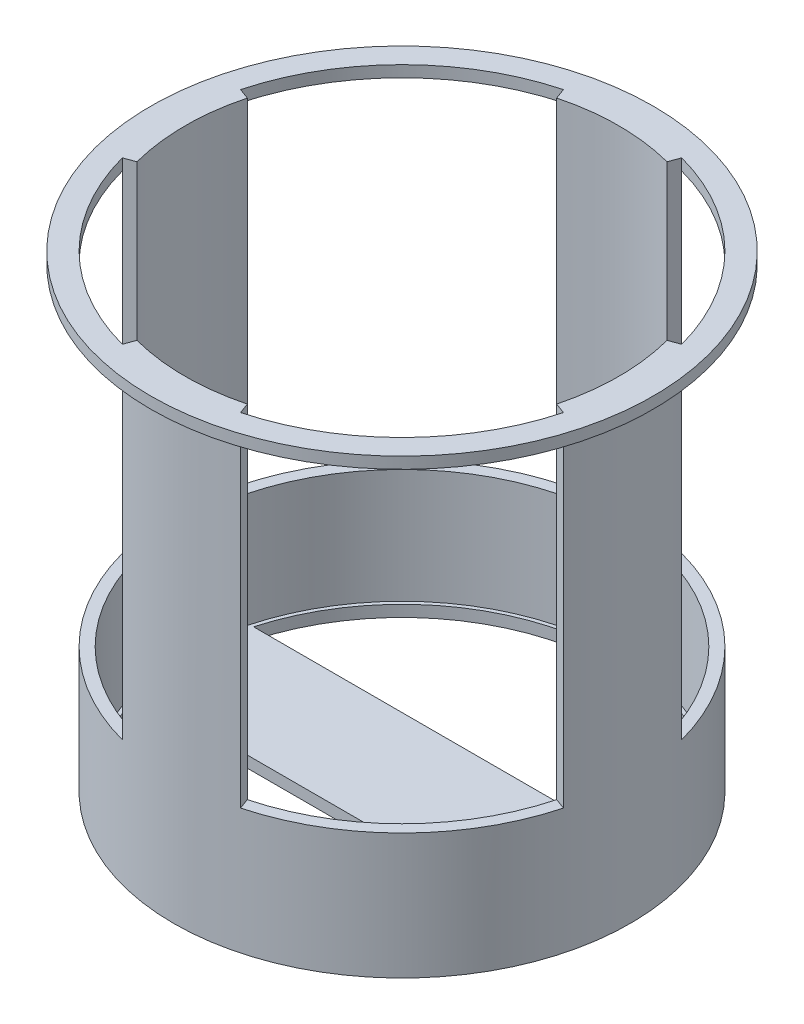
ISO-10303-21;
HEADER;
FILE_DESCRIPTION(('STEP AP214'),'2;1');
FILE_NAME('part.step','',(''),(''),'','','');
FILE_SCHEMA(('AUTOMOTIVE_DESIGN { 1 0 10303 214 1 1 1 1 }'));
ENDSEC;
DATA;
#1=APPLICATION_CONTEXT('core data for automotive mechanical design processes');
#2=APPLICATION_PROTOCOL_DEFINITION('international standard','automotive_design',2000,#1);
#3=PRODUCT_CONTEXT('',#1,'mechanical');
#4=PRODUCT('Part','Part','',(#3));
#5=PRODUCT_RELATED_PRODUCT_CATEGORY('part','',(#4));
#6=PRODUCT_DEFINITION_FORMATION('','',#4);
#7=PRODUCT_DEFINITION_CONTEXT('part definition',#1,'design');
#8=PRODUCT_DEFINITION('design','',#6,#7);
#9=PRODUCT_DEFINITION_SHAPE('','',#8);
#10=(LENGTH_UNIT() NAMED_UNIT(*) SI_UNIT(.MILLI.,.METRE.));
#11=(NAMED_UNIT(*) PLANE_ANGLE_UNIT() SI_UNIT($,.RADIAN.));
#12=(NAMED_UNIT(*) SI_UNIT($,.STERADIAN.) SOLID_ANGLE_UNIT());
#13=UNCERTAINTY_MEASURE_WITH_UNIT(LENGTH_MEASURE(1.E-05),#10,'distance_accuracy_value','');
#14=(GEOMETRIC_REPRESENTATION_CONTEXT(3) GLOBAL_UNCERTAINTY_ASSIGNED_CONTEXT((#13)) GLOBAL_UNIT_ASSIGNED_CONTEXT((#10,
#11,#12)) REPRESENTATION_CONTEXT('',''));
#15=CARTESIAN_POINT('',(0.,0.,0.));
#16=DIRECTION('',(0.,0.,1.));
#17=DIRECTION('',(1.,0.,0.));
#18=AXIS2_PLACEMENT_3D('',#15,#16,#17);
#19=CARTESIAN_POINT('',(0.,-39.,0.));
#20=DIRECTION('',(0.,1.,0.));
#21=DIRECTION('',(0.,0.,1.));
#22=AXIS2_PLACEMENT_3D('',#19,#20,#21);
#23=PLANE('',#22);
#24=CARTESIAN_POINT('',(0.,-39.,0.));
#25=DIRECTION('',(0.,1.,0.));
#26=DIRECTION('',(0.,0.,1.));
#27=AXIS2_PLACEMENT_3D('',#24,#25,#26);
#28=CIRCLE('',#27,19.0041470652043);
#29=CARTESIAN_POINT('',(-18.3789578178851,-39.,4.83440949903036));
#30=VERTEX_POINT('',#29);
#31=CARTESIAN_POINT('',(-4.83529775518471,-39.,18.3787241476284));
#32=VERTEX_POINT('',#31);
#33=EDGE_CURVE('E301',#30,#32,#28,.T.);
#34=ORIENTED_EDGE('',*,*,#33,.T.);
#35=DIRECTION('',(-0.341160355566479,0.,0.940005112640221));
#36=VECTOR('',#35,1.);
#37=CARTESIAN_POINT('',(-4.8352491416951,-39.,18.3785902020277));
#38=LINE('',#37,#36);
#39=CARTESIAN_POINT('',(-4.8352491416951,-39.,18.3785902020277));
#40=VERTEX_POINT('',#39);
#41=EDGE_CURVE('E415',#40,#32,#38,.T.);
#42=ORIENTED_EDGE('',*,*,#41,.F.);
#43=CARTESIAN_POINT('',(0.,-39.,0.));
#44=DIRECTION('',(0.,-1.,0.));
#45=DIRECTION('',(0.,0.,-1.));
#46=AXIS2_PLACEMENT_3D('',#43,#44,#45);
#47=CIRCLE('',#46,19.0040051588167);
#48=CARTESIAN_POINT('',(4.83436075872464,-39.,18.3788239049955));
#49=VERTEX_POINT('',#48);
#50=EDGE_CURVE('E421',#49,#40,#47,.T.);
#51=ORIENTED_EDGE('',*,*,#50,.F.);
#52=DIRECTION('',(-0.34202014332566,0.,-0.939692620785912));
#53=VECTOR('',#52,1.);
#54=CARTESIAN_POINT('',(5.1763809020503,-39.,19.3185165257814));
#55=LINE('',#54,#53);
#56=CARTESIAN_POINT('',(4.83440949903042,-39.,18.378957817885));
#57=VERTEX_POINT('',#56);
#58=EDGE_CURVE('E426',#57,#49,#55,.T.);
#59=ORIENTED_EDGE('',*,*,#58,.F.);
#60=CARTESIAN_POINT('',(18.3787241476284,-39.,4.83529775518464));
#61=VERTEX_POINT('',#60);
#62=EDGE_CURVE('E309',#57,#61,#28,.T.);
#63=ORIENTED_EDGE('',*,*,#62,.T.);
#64=DIRECTION('',(0.940005112640222,0.,0.341160355566474));
#65=VECTOR('',#64,1.);
#66=CARTESIAN_POINT('',(18.3785902020277,-39.,4.83524914169503));
#67=LINE('',#66,#65);
#68=CARTESIAN_POINT('',(18.3785902020277,-39.,4.83524914169503));
#69=VERTEX_POINT('',#68);
#70=EDGE_CURVE('E455',#69,#61,#67,.T.);
#71=ORIENTED_EDGE('',*,*,#70,.F.);
#72=CARTESIAN_POINT('',(0.,-39.,0.));
#73=DIRECTION('',(0.,-1.,0.));
#74=DIRECTION('',(0.,0.,-1.));
#75=AXIS2_PLACEMENT_3D('',#72,#73,#74);
#76=CIRCLE('',#75,19.0040051588167);
#77=CARTESIAN_POINT('',(18.3788239049955,-39.,-4.83436075872471));
#78=VERTEX_POINT('',#77);
#79=EDGE_CURVE('E461',#78,#69,#76,.T.);
#80=ORIENTED_EDGE('',*,*,#79,.F.);
#81=DIRECTION('',(-0.939692620785911,0.,0.342020143325662));
#82=VECTOR('',#81,1.);
#83=CARTESIAN_POINT('',(19.3185165257814,-39.,-5.17638090205037));
#84=LINE('',#83,#82);
#85=CARTESIAN_POINT('',(18.378957817885,-39.,-4.83440949903049));
#86=VERTEX_POINT('',#85);
#87=EDGE_CURVE('E465',#86,#78,#84,.T.);
#88=ORIENTED_EDGE('',*,*,#87,.F.);
#89=CARTESIAN_POINT('',(4.83529775518458,-39.,-18.3787241476284));
#90=VERTEX_POINT('',#89);
#91=EDGE_CURVE('E313',#86,#90,#28,.T.);
#92=ORIENTED_EDGE('',*,*,#91,.T.);
#93=DIRECTION('',(0.341160355566472,0.,-0.940005112640223));
#94=VECTOR('',#93,1.);
#95=CARTESIAN_POINT('',(4.83524914169497,-39.,-18.3785902020277));
#96=LINE('',#95,#94);
#97=CARTESIAN_POINT('',(4.83524914169497,-39.,-18.3785902020277));
#98=VERTEX_POINT('',#97);
#99=EDGE_CURVE('E502',#98,#90,#96,.T.);
#100=ORIENTED_EDGE('',*,*,#99,.F.);
#101=CARTESIAN_POINT('',(0.,-39.,0.));
#102=DIRECTION('',(0.,-1.,0.));
#103=DIRECTION('',(0.,0.,-1.));
#104=AXIS2_PLACEMENT_3D('',#101,#102,#103);
#105=CIRCLE('',#104,19.0040051588167);
#106=CARTESIAN_POINT('',(-4.83436075872477,-39.,-18.3788239049955));
#107=VERTEX_POINT('',#106);
#108=EDGE_CURVE('E508',#107,#98,#105,.T.);
#109=ORIENTED_EDGE('',*,*,#108,.F.);
#110=DIRECTION('',(0.342020143325666,0.,0.939692620785909));
#111=VECTOR('',#110,1.);
#112=CARTESIAN_POINT('',(-5.17638090205043,-39.,-19.3185165257814));
#113=LINE('',#112,#111);
#114=CARTESIAN_POINT('',(-4.83440949903055,-39.,-18.378957817885));
#115=VERTEX_POINT('',#114);
#116=EDGE_CURVE('E513',#115,#107,#113,.T.);
#117=ORIENTED_EDGE('',*,*,#116,.F.);
#118=CARTESIAN_POINT('',(-18.3787241476284,-39.,-4.83529775518477));
#119=VERTEX_POINT('',#118);
#120=EDGE_CURVE('E572',#115,#119,#28,.T.);
#121=ORIENTED_EDGE('',*,*,#120,.T.);
#122=DIRECTION('',(-0.94000511264022,0.,-0.341160355566482));
#123=VECTOR('',#122,1.);
#124=CARTESIAN_POINT('',(-18.3785902020276,-39.,-4.83524914169516));
#125=LINE('',#124,#123);
#126=CARTESIAN_POINT('',(-18.3785902020276,-39.,-4.83524914169516));
#127=VERTEX_POINT('',#126);
#128=EDGE_CURVE('E375',#127,#119,#125,.T.);
#129=ORIENTED_EDGE('',*,*,#128,.F.);
#130=CARTESIAN_POINT('',(0.,-39.,0.));
#131=DIRECTION('',(0.,-1.,0.));
#132=DIRECTION('',(0.,0.,-1.));
#133=AXIS2_PLACEMENT_3D('',#130,#131,#132);
#134=CIRCLE('',#133,19.0040051588167);
#135=CARTESIAN_POINT('',(-18.3788239049955,-39.,4.83436075872457));
#136=VERTEX_POINT('',#135);
#137=EDGE_CURVE('E381',#136,#127,#134,.T.);
#138=ORIENTED_EDGE('',*,*,#137,.F.);
#139=DIRECTION('',(0.939692620785913,0.,-0.342020143325656));
#140=VECTOR('',#139,1.);
#141=CARTESIAN_POINT('',(-19.3185165257814,-39.,5.17638090205023));
#142=LINE('',#141,#140);
#143=EDGE_CURVE('E386',#30,#136,#142,.T.);
#144=ORIENTED_EDGE('',*,*,#143,.F.);
#145=EDGE_LOOP('',(#34,#42,#51,#59,#63,#71,#80,#88,#92,#100,#109,#117,#121,#129,#138,#144));
#146=FACE_BOUND('',#145,.T.);
#147=CARTESIAN_POINT('',(0.,-39.,0.));
#148=DIRECTION('',(0.,1.,0.));
#149=DIRECTION('',(0.,0.,1.));
#150=AXIS2_PLACEMENT_3D('',#147,#148,#149);
#151=CIRCLE('',#150,18.6815416922694);
#152=CARTESIAN_POINT('',(18.,-39.,-5.));
#153=VERTEX_POINT('',#152);
#154=CARTESIAN_POINT('',(-18.,-39.,-5.));
#155=VERTEX_POINT('',#154);
#156=EDGE_CURVE('E262',#153,#155,#151,.T.);
#157=ORIENTED_EDGE('',*,*,#156,.F.);
#158=DIRECTION('',(-1.,0.,0.));
#159=VECTOR('',#158,1.);
#160=CARTESIAN_POINT('',(0.,-39.,-5.));
#161=LINE('',#160,#159);
#162=EDGE_CURVE('E292',#153,#155,#161,.T.);
#163=ORIENTED_EDGE('',*,*,#162,.T.);
#164=EDGE_LOOP('',(#157,#163));
#165=FACE_BOUND('',#164,.T.);
#166=DIRECTION('',(-1.,0.,0.));
#167=VECTOR('',#166,1.);
#168=CARTESIAN_POINT('',(0.,-39.,5.));
#169=LINE('',#168,#167);
#170=CARTESIAN_POINT('',(18.,-39.,5.));
#171=VERTEX_POINT('',#170);
#172=CARTESIAN_POINT('',(-18.,-39.,5.));
#173=VERTEX_POINT('',#172);
#174=EDGE_CURVE('E296',#171,#173,#169,.T.);
#175=ORIENTED_EDGE('',*,*,#174,.F.);
#176=CARTESIAN_POINT('',(0.,-39.,0.));
#177=DIRECTION('',(0.,1.,0.));
#178=DIRECTION('',(0.,0.,1.));
#179=AXIS2_PLACEMENT_3D('',#176,#177,#178);
#180=CIRCLE('',#179,18.6815416922694);
#181=EDGE_CURVE('E259',#171,#173,#180,.F.);
#182=ORIENTED_EDGE('',*,*,#181,.T.);
#183=EDGE_LOOP('',(#175,#182));
#184=FACE_BOUND('',#183,.T.);
#185=ADVANCED_FACE('F45',(#146,#165,#184),#23,.T.);
#186=CARTESIAN_POINT('',(0.,-40.,0.));
#187=DIRECTION('',(0.,1.,0.));
#188=DIRECTION('',(0.,0.,1.));
#189=AXIS2_PLACEMENT_3D('',#186,#187,#188);
#190=PLANE('',#189);
#191=DIRECTION('',(1.,0.,0.));
#192=VECTOR('',#191,1.);
#193=CARTESIAN_POINT('',(0.,-40.,-5.));
#194=LINE('',#193,#192);
#195=CARTESIAN_POINT('',(-18.,-40.,-5.));
#196=VERTEX_POINT('',#195);
#197=CARTESIAN_POINT('',(18.,-40.,-5.));
#198=VERTEX_POINT('',#197);
#199=EDGE_CURVE('E280',#196,#198,#194,.T.);
#200=ORIENTED_EDGE('',*,*,#199,.T.);
#201=CARTESIAN_POINT('',(0.,-40.,0.));
#202=DIRECTION('',(0.,-1.,0.));
#203=DIRECTION('',(0.,0.,-1.));
#204=AXIS2_PLACEMENT_3D('',#201,#202,#203);
#205=CIRCLE('',#204,18.6815416922694);
#206=EDGE_CURVE('E284',#196,#198,#205,.T.);
#207=ORIENTED_EDGE('',*,*,#206,.F.);
#208=EDGE_LOOP('',(#200,#207));
#209=FACE_BOUND('',#208,.T.);
#210=CARTESIAN_POINT('',(0.,-40.,0.));
#211=DIRECTION('',(0.,1.,0.));
#212=DIRECTION('',(0.,0.,1.));
#213=AXIS2_PLACEMENT_3D('',#210,#211,#212);
#214=CIRCLE('',#213,20.);
#215=CARTESIAN_POINT('',(0.,-40.,20.));
#216=VERTEX_POINT('',#215);
#217=EDGE_CURVE('E497',#216,#216,#214,.T.);
#218=ORIENTED_EDGE('',*,*,#217,.F.);
#219=EDGE_LOOP('',(#218));
#220=FACE_BOUND('',#219,.T.);
#221=CARTESIAN_POINT('',(0.,-40.,0.));
#222=DIRECTION('',(0.,-1.,0.));
#223=DIRECTION('',(0.,0.,-1.));
#224=AXIS2_PLACEMENT_3D('',#221,#222,#223);
#225=CIRCLE('',#224,18.6815416922694);
#226=CARTESIAN_POINT('',(-18.,-40.,5.));
#227=VERTEX_POINT('',#226);
#228=CARTESIAN_POINT('',(18.,-40.,5.));
#229=VERTEX_POINT('',#228);
#230=EDGE_CURVE('E256',#227,#229,#225,.F.);
#231=ORIENTED_EDGE('',*,*,#230,.T.);
#232=DIRECTION('',(1.,0.,0.));
#233=VECTOR('',#232,1.);
#234=CARTESIAN_POINT('',(0.,-40.,5.));
#235=LINE('',#234,#233);
#236=EDGE_CURVE('E266',#227,#229,#235,.T.);
#237=ORIENTED_EDGE('',*,*,#236,.F.);
#238=EDGE_LOOP('',(#231,#237));
#239=FACE_BOUND('',#238,.T.);
#240=ADVANCED_FACE('F271',(#209,#220,#239),#190,.F.);
#241=CARTESIAN_POINT('',(0.,0.,0.));
#242=DIRECTION('',(0.,1.,0.));
#243=DIRECTION('',(0.,0.,1.));
#244=AXIS2_PLACEMENT_3D('',#241,#242,#243);
#245=CYLINDRICAL_SURFACE('',#244,20.);
#246=DIRECTION('',(0.,-1.,0.));
#247=VECTOR('',#246,1.);
#248=CARTESIAN_POINT('',(-19.3185165257814,11.4789621005809,5.17638090205024));
#249=LINE('',#248,#247);
#250=CARTESIAN_POINT('',(-19.3185165257814,1.,5.17638090205024));
#251=VERTEX_POINT('',#250);
#252=CARTESIAN_POINT('',(-19.3185165257814,0.,5.17638090205023));
#253=VERTEX_POINT('',#252);
#254=EDGE_CURVE('E389',#251,#253,#249,.T.);
#255=ORIENTED_EDGE('',*,*,#254,.F.);
#256=CARTESIAN_POINT('',(0.,1.,0.));
#257=DIRECTION('',(0.,1.,0.));
#258=DIRECTION('',(0.,0.,1.));
#259=AXIS2_PLACEMENT_3D('',#256,#257,#258);
#260=CIRCLE('',#259,20.);
#261=CARTESIAN_POINT('',(-5.17638090205056,1.,19.3185165257813));
#262=VERTEX_POINT('',#261);
#263=EDGE_CURVE('E555',#251,#262,#260,.T.);
#264=ORIENTED_EDGE('',*,*,#263,.T.);
#265=DIRECTION('',(0.,-1.,0.));
#266=VECTOR('',#265,1.);
#267=CARTESIAN_POINT('',(-5.17638090205056,11.4789621005809,19.3185165257813));
#268=LINE('',#267,#266);
#269=CARTESIAN_POINT('',(-5.17638090205056,0.,19.3185165257813));
#270=VERTEX_POINT('',#269);
#271=EDGE_CURVE('E451',#262,#270,#268,.T.);
#272=ORIENTED_EDGE('',*,*,#271,.T.);
#273=CARTESIAN_POINT('',(0.,0.,0.));
#274=DIRECTION('',(0.,1.,0.));
#275=DIRECTION('',(0.,0.,1.));
#276=AXIS2_PLACEMENT_3D('',#273,#274,#275);
#277=CIRCLE('',#276,20.);
#278=EDGE_CURVE('E549',#253,#270,#277,.T.);
#279=ORIENTED_EDGE('',*,*,#278,.F.);
#280=EDGE_LOOP('',(#255,#264,#272,#279));
#281=FACE_BOUND('',#280,.T.);
#282=ADVANCED_FACE('F647',(#281),#245,.F.);
#283=DIRECTION('',(0.,-1.,0.));
#284=VECTOR('',#283,1.);
#285=CARTESIAN_POINT('',(-19.3185165257813,11.4789621005809,-5.17638090205063));
#286=LINE('',#285,#284);
#287=CARTESIAN_POINT('',(-19.3185165257813,1.,-5.17638090205063));
#288=VERTEX_POINT('',#287);
#289=CARTESIAN_POINT('',(-19.3185165257813,0.,-5.17638090205063));
#290=VERTEX_POINT('',#289);
#291=EDGE_CURVE('E411',#288,#290,#286,.T.);
#292=ORIENTED_EDGE('',*,*,#291,.T.);
#293=CARTESIAN_POINT('',(-5.17638090205043,0.,-19.3185165257814));
#294=VERTEX_POINT('',#293);
#295=EDGE_CURVE('E548',#294,#290,#277,.T.);
#296=ORIENTED_EDGE('',*,*,#295,.F.);
#297=DIRECTION('',(0.,-1.,0.));
#298=VECTOR('',#297,1.);
#299=CARTESIAN_POINT('',(-5.17638090205043,11.4789621005809,-19.3185165257814));
#300=LINE('',#299,#298);
#301=CARTESIAN_POINT('',(-5.17638090205043,1.,-19.3185165257814));
#302=VERTEX_POINT('',#301);
#303=EDGE_CURVE('E516',#302,#294,#300,.T.);
#304=ORIENTED_EDGE('',*,*,#303,.F.);
#305=EDGE_CURVE('E550',#302,#288,#260,.T.);
#306=ORIENTED_EDGE('',*,*,#305,.T.);
#307=EDGE_LOOP('',(#292,#296,#304,#306));
#308=FACE_BOUND('',#307,.T.);
#309=ADVANCED_FACE('F709',(#308),#245,.F.);
#310=DIRECTION('',(0.,-1.,0.));
#311=VECTOR('',#310,1.);
#312=CARTESIAN_POINT('',(5.17638090205031,11.4789621005809,19.3185165257814));
#313=LINE('',#312,#311);
#314=CARTESIAN_POINT('',(5.17638090205031,1.,19.3185165257814));
#315=VERTEX_POINT('',#314);
#316=CARTESIAN_POINT('',(5.1763809020503,0.,19.3185165257814));
#317=VERTEX_POINT('',#316);
#318=EDGE_CURVE('E429',#315,#317,#313,.T.);
#319=ORIENTED_EDGE('',*,*,#318,.F.);
#320=CARTESIAN_POINT('',(19.3185165257814,1.,5.17638090205049));
#321=VERTEX_POINT('',#320);
#322=EDGE_CURVE('E701',#315,#321,#260,.T.);
#323=ORIENTED_EDGE('',*,*,#322,.T.);
#324=DIRECTION('',(0.,-1.,0.));
#325=VECTOR('',#324,1.);
#326=CARTESIAN_POINT('',(19.3185165257814,11.4789621005809,5.17638090205049));
#327=LINE('',#326,#325);
#328=CARTESIAN_POINT('',(19.3185165257814,0.,5.17638090205049));
#329=VERTEX_POINT('',#328);
#330=EDGE_CURVE('E490',#321,#329,#327,.T.);
#331=ORIENTED_EDGE('',*,*,#330,.T.);
#332=EDGE_CURVE('E658',#317,#329,#277,.T.);
#333=ORIENTED_EDGE('',*,*,#332,.F.);
#334=EDGE_LOOP('',(#319,#323,#331,#333));
#335=FACE_BOUND('',#334,.T.);
#336=ADVANCED_FACE('F707',(#335),#245,.F.);
#337=DIRECTION('',(0.,-1.,0.));
#338=VECTOR('',#337,1.);
#339=CARTESIAN_POINT('',(19.3185165257814,11.4789621005809,-5.17638090205037));
#340=LINE('',#339,#338);
#341=CARTESIAN_POINT('',(19.3185165257814,1.,-5.17638090205037));
#342=VERTEX_POINT('',#341);
#343=CARTESIAN_POINT('',(19.3185165257814,0.,-5.17638090205037));
#344=VERTEX_POINT('',#343);
#345=EDGE_CURVE('E468',#342,#344,#340,.T.);
#346=ORIENTED_EDGE('',*,*,#345,.F.);
#347=CARTESIAN_POINT('',(5.17638090205043,1.,-19.3185165257814));
#348=VERTEX_POINT('',#347);
#349=EDGE_CURVE('E521',#342,#348,#260,.T.);
#350=ORIENTED_EDGE('',*,*,#349,.T.);
#351=DIRECTION('',(0.,-1.,0.));
#352=VECTOR('',#351,1.);
#353=CARTESIAN_POINT('',(5.17638090205043,11.4789621005809,-19.3185165257814));
#354=LINE('',#353,#352);
#355=CARTESIAN_POINT('',(5.17638090205043,0.,-19.3185165257814));
#356=VERTEX_POINT('',#355);
#357=EDGE_CURVE('E530',#348,#356,#354,.T.);
#358=ORIENTED_EDGE('',*,*,#357,.T.);
#359=EDGE_CURVE('E554',#344,#356,#277,.T.);
#360=ORIENTED_EDGE('',*,*,#359,.F.);
#361=EDGE_LOOP('',(#346,#350,#358,#360));
#362=FACE_BOUND('',#361,.T.);
#363=ADVANCED_FACE('F670',(#362),#245,.F.);
#364=CARTESIAN_POINT('',(0.,1.,0.));
#365=DIRECTION('',(0.,-1.,0.));
#366=DIRECTION('',(0.,0.,-1.));
#367=AXIS2_PLACEMENT_3D('',#364,#365,#366);
#368=CYLINDRICAL_SURFACE('',#367,22.);
#369=CARTESIAN_POINT('',(0.,1.,0.));
#370=DIRECTION('',(0.,1.,0.));
#371=DIRECTION('',(0.,0.,1.));
#372=AXIS2_PLACEMENT_3D('',#369,#370,#371);
#373=CIRCLE('',#372,22.);
#374=CARTESIAN_POINT('',(0.,1.,22.));
#375=VERTEX_POINT('',#374);
#376=EDGE_CURVE('E556',#375,#375,#373,.T.);
#377=ORIENTED_EDGE('',*,*,#376,.F.);
#378=EDGE_LOOP('',(#377));
#379=FACE_BOUND('',#378,.T.);
#380=CARTESIAN_POINT('',(0.,0.,0.));
#381=DIRECTION('',(0.,1.,0.));
#382=DIRECTION('',(0.,0.,1.));
#383=AXIS2_PLACEMENT_3D('',#380,#381,#382);
#384=CIRCLE('',#383,22.);
#385=CARTESIAN_POINT('',(0.,0.,22.));
#386=VERTEX_POINT('',#385);
#387=EDGE_CURVE('E547',#386,#386,#384,.T.);
#388=ORIENTED_EDGE('',*,*,#387,.T.);
#389=EDGE_LOOP('',(#388));
#390=FACE_BOUND('',#389,.T.);
#391=ADVANCED_FACE('F47',(#379,#390),#368,.T.);
#392=CARTESIAN_POINT('',(0.,1.,0.));
#393=DIRECTION('',(0.,1.,0.));
#394=DIRECTION('',(0.,0.,1.));
#395=AXIS2_PLACEMENT_3D('',#392,#393,#394);
#396=PLANE('',#395);
#397=ORIENTED_EDGE('',*,*,#305,.F.);
#398=DIRECTION('',(0.342020143325666,0.,0.939692620785909));
#399=VECTOR('',#398,1.);
#400=CARTESIAN_POINT('',(-5.17638090205043,1.,-19.3185165257814));
#401=LINE('',#400,#399);
#402=CARTESIAN_POINT('',(-4.83436075872477,1.,-18.3788239049955));
#403=VERTEX_POINT('',#402);
#404=EDGE_CURVE('E526',#302,#403,#401,.T.);
#405=ORIENTED_EDGE('',*,*,#404,.T.);
#406=CARTESIAN_POINT('',(0.,1.,0.));
#407=DIRECTION('',(0.,1.,0.));
#408=DIRECTION('',(0.,0.,1.));
#409=AXIS2_PLACEMENT_3D('',#406,#407,#408);
#410=CIRCLE('',#409,19.0040051588167);
#411=CARTESIAN_POINT('',(4.83524914169497,1.,-18.3785902020277));
#412=VERTEX_POINT('',#411);
#413=EDGE_CURVE('E522',#403,#412,#410,.F.);
#414=ORIENTED_EDGE('',*,*,#413,.T.);
#415=DIRECTION('',(0.341160355566472,0.,-0.940005112640223));
#416=VECTOR('',#415,1.);
#417=CARTESIAN_POINT('',(4.83524914169497,1.,-18.3785902020277));
#418=LINE('',#417,#416);
#419=EDGE_CURVE('E517',#412,#348,#418,.T.);
#420=ORIENTED_EDGE('',*,*,#419,.T.);
#421=ORIENTED_EDGE('',*,*,#349,.F.);
#422=DIRECTION('',(-0.939692620785911,0.,0.342020143325662));
#423=VECTOR('',#422,1.);
#424=CARTESIAN_POINT('',(19.3185165257814,1.,-5.17638090205037));
#425=LINE('',#424,#423);
#426=CARTESIAN_POINT('',(18.3788239049955,1.,-4.83436075872471));
#427=VERTEX_POINT('',#426);
#428=EDGE_CURVE('E474',#342,#427,#425,.T.);
#429=ORIENTED_EDGE('',*,*,#428,.T.);
#430=CARTESIAN_POINT('',(0.,1.,0.));
#431=DIRECTION('',(0.,1.,0.));
#432=DIRECTION('',(0.,0.,1.));
#433=AXIS2_PLACEMENT_3D('',#430,#431,#432);
#434=CIRCLE('',#433,19.0040051588167);
#435=CARTESIAN_POINT('',(18.3785902020277,1.,4.83524914169503));
#436=VERTEX_POINT('',#435);
#437=EDGE_CURVE('E469',#427,#436,#434,.F.);
#438=ORIENTED_EDGE('',*,*,#437,.T.);
#439=DIRECTION('',(0.940005112640222,0.,0.341160355566474));
#440=VECTOR('',#439,1.);
#441=CARTESIAN_POINT('',(18.3785902020277,1.,4.83524914169503));
#442=LINE('',#441,#440);
#443=EDGE_CURVE('E459',#436,#321,#442,.T.);
#444=ORIENTED_EDGE('',*,*,#443,.T.);
#445=ORIENTED_EDGE('',*,*,#322,.F.);
#446=DIRECTION('',(-0.34202014332566,0.,-0.939692620785912));
#447=VECTOR('',#446,1.);
#448=CARTESIAN_POINT('',(5.1763809020503,1.,19.3185165257814));
#449=LINE('',#448,#447);
#450=CARTESIAN_POINT('',(4.83436075872464,1.,18.3788239049955));
#451=VERTEX_POINT('',#450);
#452=EDGE_CURVE('E435',#315,#451,#449,.T.);
#453=ORIENTED_EDGE('',*,*,#452,.T.);
#454=CARTESIAN_POINT('',(0.,1.,0.));
#455=DIRECTION('',(0.,1.,0.));
#456=DIRECTION('',(0.,0.,1.));
#457=AXIS2_PLACEMENT_3D('',#454,#455,#456);
#458=CIRCLE('',#457,19.0040051588167);
#459=CARTESIAN_POINT('',(-4.83524914169509,1.,18.3785902020277));
#460=VERTEX_POINT('',#459);
#461=EDGE_CURVE('E430',#451,#460,#458,.F.);
#462=ORIENTED_EDGE('',*,*,#461,.T.);
#463=DIRECTION('',(-0.341160355566479,0.,0.940005112640221));
#464=VECTOR('',#463,1.);
#465=CARTESIAN_POINT('',(-4.8352491416951,1.,18.3785902020277));
#466=LINE('',#465,#464);
#467=EDGE_CURVE('E419',#460,#262,#466,.T.);
#468=ORIENTED_EDGE('',*,*,#467,.T.);
#469=ORIENTED_EDGE('',*,*,#263,.F.);
#470=DIRECTION('',(0.939692620785913,0.,-0.342020143325656));
#471=VECTOR('',#470,1.);
#472=CARTESIAN_POINT('',(-19.3185165257814,1.,5.17638090205023));
#473=LINE('',#472,#471);
#474=CARTESIAN_POINT('',(-18.3788239049955,1.,4.83436075872457));
#475=VERTEX_POINT('',#474);
#476=EDGE_CURVE('E395',#251,#475,#473,.T.);
#477=ORIENTED_EDGE('',*,*,#476,.T.);
#478=CARTESIAN_POINT('',(0.,1.,0.));
#479=DIRECTION('',(0.,1.,0.));
#480=DIRECTION('',(0.,0.,1.));
#481=AXIS2_PLACEMENT_3D('',#478,#479,#480);
#482=CIRCLE('',#481,19.0040051588167);
#483=CARTESIAN_POINT('',(-18.3785902020276,1.,-4.83524914169515));
#484=VERTEX_POINT('',#483);
#485=EDGE_CURVE('E390',#475,#484,#482,.F.);
#486=ORIENTED_EDGE('',*,*,#485,.T.);
#487=DIRECTION('',(-0.940005112640219,0.,-0.341160355566482));
#488=VECTOR('',#487,1.);
#489=CARTESIAN_POINT('',(-18.3785902020276,1.,-4.83524914169516));
#490=LINE('',#489,#488);
#491=EDGE_CURVE('E379',#484,#288,#490,.T.);
#492=ORIENTED_EDGE('',*,*,#491,.T.);
#493=EDGE_LOOP('',(#397,#405,#414,#420,#421,#429,#438,#444,#445,#453,#462,#468,#469,#477,#486,#492));
#494=FACE_BOUND('',#493,.T.);
#495=ORIENTED_EDGE('',*,*,#376,.T.);
#496=EDGE_LOOP('',(#495));
#497=FACE_BOUND('',#496,.T.);
#498=ADVANCED_FACE('F698',(#494,#497),#396,.T.);
#499=CARTESIAN_POINT('',(0.,0.,0.));
#500=DIRECTION('',(0.,1.,0.));
#501=DIRECTION('',(0.,0.,1.));
#502=AXIS2_PLACEMENT_3D('',#499,#500,#501);
#503=PLANE('',#502);
#504=EDGE_CURVE('E543',#356,#294,#277,.T.);
#505=ORIENTED_EDGE('',*,*,#504,.T.);
#506=ORIENTED_EDGE('',*,*,#295,.T.);
#507=EDGE_CURVE('E645',#290,#253,#277,.T.);
#508=ORIENTED_EDGE('',*,*,#507,.T.);
#509=ORIENTED_EDGE('',*,*,#278,.T.);
#510=EDGE_CURVE('E653',#270,#317,#277,.T.);
#511=ORIENTED_EDGE('',*,*,#510,.T.);
#512=ORIENTED_EDGE('',*,*,#332,.T.);
#513=CARTESIAN_POINT('',(0.,0.,0.));
#514=DIRECTION('',(0.,1.,0.));
#515=DIRECTION('',(0.,0.,1.));
#516=AXIS2_PLACEMENT_3D('',#513,#514,#515);
#517=CIRCLE('',#516,20.);
#518=EDGE_CURVE('E473',#344,#329,#517,.F.);
#519=ORIENTED_EDGE('',*,*,#518,.F.);
#520=ORIENTED_EDGE('',*,*,#359,.T.);
#521=EDGE_LOOP('',(#505,#506,#508,#509,#511,#512,#519,#520));
#522=FACE_BOUND('',#521,.T.);
#523=ORIENTED_EDGE('',*,*,#387,.F.);
#524=EDGE_LOOP('',(#523));
#525=FACE_BOUND('',#524,.T.);
#526=ADVANCED_FACE('F655',(#522,#525),#503,.F.);
#527=CARTESIAN_POINT('',(0.,11.4789621005809,0.));
#528=DIRECTION('',(0.,-1.,0.));
#529=DIRECTION('',(0.,0.,-1.));
#530=AXIS2_PLACEMENT_3D('',#527,#528,#529);
#531=CYLINDRICAL_SURFACE('',#530,20.);
#532=CARTESIAN_POINT('',(-5.17638090205056,-29.,19.3185165257813));
#533=VERTEX_POINT('',#532);
#534=EDGE_CURVE('E394',#270,#533,#268,.T.);
#535=ORIENTED_EDGE('',*,*,#534,.T.);
#536=CARTESIAN_POINT('',(0.,-29.,0.));
#537=DIRECTION('',(0.,1.,0.));
#538=DIRECTION('',(0.,0.,1.));
#539=AXIS2_PLACEMENT_3D('',#536,#537,#538);
#540=CIRCLE('',#539,20.);
#541=CARTESIAN_POINT('',(-19.3185165257814,-29.,5.17638090205023));
#542=VERTEX_POINT('',#541);
#543=EDGE_CURVE('E306',#542,#533,#540,.T.);
#544=ORIENTED_EDGE('',*,*,#543,.F.);
#545=EDGE_CURVE('E404',#253,#542,#249,.T.);
#546=ORIENTED_EDGE('',*,*,#545,.F.);
#547=ORIENTED_EDGE('',*,*,#507,.F.);
#548=CARTESIAN_POINT('',(-19.3185165257813,-29.,-5.17638090205063));
#549=VERTEX_POINT('',#548);
#550=EDGE_CURVE('E374',#290,#549,#286,.T.);
#551=ORIENTED_EDGE('',*,*,#550,.T.);
#552=CARTESIAN_POINT('',(-5.17638090205043,-29.,-19.3185165257814));
#553=VERTEX_POINT('',#552);
#554=EDGE_CURVE('E627',#553,#549,#540,.T.);
#555=ORIENTED_EDGE('',*,*,#554,.F.);
#556=EDGE_CURVE('E501',#294,#553,#300,.T.);
#557=ORIENTED_EDGE('',*,*,#556,.F.);
#558=ORIENTED_EDGE('',*,*,#504,.F.);
#559=CARTESIAN_POINT('',(5.17638090205043,-29.,-19.3185165257814));
#560=VERTEX_POINT('',#559);
#561=EDGE_CURVE('E506',#356,#560,#354,.T.);
#562=ORIENTED_EDGE('',*,*,#561,.T.);
#563=CARTESIAN_POINT('',(19.3185165257814,-29.,-5.17638090205037));
#564=VERTEX_POINT('',#563);
#565=EDGE_CURVE('E318',#564,#560,#540,.T.);
#566=ORIENTED_EDGE('',*,*,#565,.F.);
#567=EDGE_CURVE('E483',#344,#564,#340,.T.);
#568=ORIENTED_EDGE('',*,*,#567,.F.);
#569=ORIENTED_EDGE('',*,*,#518,.T.);
#570=CARTESIAN_POINT('',(19.3185165257813,-29.,5.17638090205049));
#571=VERTEX_POINT('',#570);
#572=EDGE_CURVE('E434',#329,#571,#327,.T.);
#573=ORIENTED_EDGE('',*,*,#572,.T.);
#574=CARTESIAN_POINT('',(5.1763809020503,-29.,19.3185165257814));
#575=VERTEX_POINT('',#574);
#576=EDGE_CURVE('E314',#575,#571,#540,.T.);
#577=ORIENTED_EDGE('',*,*,#576,.F.);
#578=EDGE_CURVE('E444',#317,#575,#313,.T.);
#579=ORIENTED_EDGE('',*,*,#578,.F.);
#580=ORIENTED_EDGE('',*,*,#510,.F.);
#581=EDGE_LOOP('',(#535,#544,#546,#547,#551,#555,#557,#558,#562,#566,#568,#569,#573,#577,#579,#580));
#582=FACE_BOUND('',#581,.T.);
#583=ORIENTED_EDGE('',*,*,#217,.T.);
#584=EDGE_LOOP('',(#583));
#585=FACE_BOUND('',#584,.T.);
#586=ADVANCED_FACE('F613',(#582,#585),#531,.T.);
#587=CARTESIAN_POINT('',(-5.17638090205043,11.4789621005809,-19.3185165257814));
#588=DIRECTION('',(0.939692620785909,0.,-0.342020143325666));
#589=DIRECTION('',(-0.342020143325666,0.,-0.939692620785909));
#590=AXIS2_PLACEMENT_3D('',#587,#588,#589);
#591=PLANE('',#590);
#592=ORIENTED_EDGE('',*,*,#556,.T.);
#593=DIRECTION('',(0.342020143325666,0.,0.939692620785909));
#594=VECTOR('',#593,1.);
#595=CARTESIAN_POINT('',(-5.17638090205043,-29.,-19.3185165257814));
#596=LINE('',#595,#594);
#597=CARTESIAN_POINT('',(-4.83440949903055,-29.,-18.378957817885));
#598=VERTEX_POINT('',#597);
#599=EDGE_CURVE('E370',#553,#598,#596,.T.);
#600=ORIENTED_EDGE('',*,*,#599,.T.);
#601=DIRECTION('',(0.,-1.,0.));
#602=VECTOR('',#601,1.);
#603=CARTESIAN_POINT('',(-4.83440949903055,-29.,-18.378957817885));
#604=LINE('',#603,#602);
#605=EDGE_CURVE('E342',#598,#115,#604,.T.);
#606=ORIENTED_EDGE('',*,*,#605,.T.);
#607=ORIENTED_EDGE('',*,*,#116,.T.);
#608=DIRECTION('',(0.,-1.,0.));
#609=VECTOR('',#608,1.);
#610=CARTESIAN_POINT('',(-4.83436075872477,11.4789621005809,-18.3788239049955));
#611=LINE('',#610,#609);
#612=EDGE_CURVE('E512',#403,#107,#611,.T.);
#613=ORIENTED_EDGE('',*,*,#612,.F.);
#614=ORIENTED_EDGE('',*,*,#404,.F.);
#615=ORIENTED_EDGE('',*,*,#303,.T.);
#616=EDGE_LOOP('',(#592,#600,#606,#607,#613,#614,#615));
#617=FACE_BOUND('',#616,.T.);
#618=ADVANCED_FACE('F730',(#617),#591,.F.);
#619=CARTESIAN_POINT('',(0.,11.4789621005809,0.));
#620=DIRECTION('',(0.,-1.,0.));
#621=DIRECTION('',(0.,0.,-1.));
#622=AXIS2_PLACEMENT_3D('',#619,#620,#621);
#623=CYLINDRICAL_SURFACE('',#622,19.0040051588167);
#624=ORIENTED_EDGE('',*,*,#413,.F.);
#625=ORIENTED_EDGE('',*,*,#612,.T.);
#626=ORIENTED_EDGE('',*,*,#108,.T.);
#627=DIRECTION('',(0.,-1.,0.));
#628=VECTOR('',#627,1.);
#629=CARTESIAN_POINT('',(4.83524914169497,11.4789621005809,-18.3785902020277));
#630=LINE('',#629,#628);
#631=EDGE_CURVE('E507',#412,#98,#630,.T.);
#632=ORIENTED_EDGE('',*,*,#631,.F.);
#633=EDGE_LOOP('',(#624,#625,#626,#632));
#634=FACE_BOUND('',#633,.T.);
#635=ADVANCED_FACE('F733',(#634),#623,.F.);
#636=CARTESIAN_POINT('',(4.83524914169497,11.4789621005809,-18.3785902020277));
#637=DIRECTION('',(-0.940005112640223,0.,-0.341160355566472));
#638=DIRECTION('',(-0.341160355566472,0.,0.940005112640223));
#639=AXIS2_PLACEMENT_3D('',#636,#637,#638);
#640=PLANE('',#639);
#641=DIRECTION('',(0.,-1.,0.));
#642=VECTOR('',#641,1.);
#643=CARTESIAN_POINT('',(4.83529775518458,-29.,-18.3787241476284));
#644=LINE('',#643,#642);
#645=CARTESIAN_POINT('',(4.83529775518458,-29.,-18.3787241476284));
#646=VERTEX_POINT('',#645);
#647=EDGE_CURVE('E338',#90,#646,#644,.F.);
#648=ORIENTED_EDGE('',*,*,#647,.T.);
#649=DIRECTION('',(0.341160355566472,0.,-0.940005112640223));
#650=VECTOR('',#649,1.);
#651=CARTESIAN_POINT('',(4.83524914169497,-29.,-18.3785902020277));
#652=LINE('',#651,#650);
#653=EDGE_CURVE('E366',#646,#560,#652,.T.);
#654=ORIENTED_EDGE('',*,*,#653,.T.);
#655=ORIENTED_EDGE('',*,*,#561,.F.);
#656=ORIENTED_EDGE('',*,*,#357,.F.);
#657=ORIENTED_EDGE('',*,*,#419,.F.);
#658=ORIENTED_EDGE('',*,*,#631,.T.);
#659=ORIENTED_EDGE('',*,*,#99,.T.);
#660=EDGE_LOOP('',(#648,#654,#655,#656,#657,#658,#659));
#661=FACE_BOUND('',#660,.T.);
#662=ADVANCED_FACE('F678',(#661),#640,.F.);
#663=CARTESIAN_POINT('',(19.3185165257814,11.4789621005809,-5.17638090205037));
#664=DIRECTION('',(0.342020143325662,0.,0.939692620785911));
#665=DIRECTION('',(0.939692620785911,0.,-0.342020143325662));
#666=AXIS2_PLACEMENT_3D('',#663,#664,#665);
#667=PLANE('',#666);
#668=ORIENTED_EDGE('',*,*,#567,.T.);
#669=DIRECTION('',(-0.939692620785911,0.,0.342020143325662));
#670=VECTOR('',#669,1.);
#671=CARTESIAN_POINT('',(19.3185165257814,-29.,-5.17638090205037));
#672=LINE('',#671,#670);
#673=CARTESIAN_POINT('',(18.378957817885,-29.,-4.83440949903049));
#674=VERTEX_POINT('',#673);
#675=EDGE_CURVE('E362',#564,#674,#672,.T.);
#676=ORIENTED_EDGE('',*,*,#675,.T.);
#677=DIRECTION('',(0.,-1.,0.));
#678=VECTOR('',#677,1.);
#679=CARTESIAN_POINT('',(18.378957817885,-29.,-4.83440949903049));
#680=LINE('',#679,#678);
#681=EDGE_CURVE('E334',#674,#86,#680,.T.);
#682=ORIENTED_EDGE('',*,*,#681,.T.);
#683=ORIENTED_EDGE('',*,*,#87,.T.);
#684=DIRECTION('',(0.,-1.,0.));
#685=VECTOR('',#684,1.);
#686=CARTESIAN_POINT('',(18.3788239049955,11.4789621005809,-4.83436075872471));
#687=LINE('',#686,#685);
#688=EDGE_CURVE('E464',#427,#78,#687,.T.);
#689=ORIENTED_EDGE('',*,*,#688,.F.);
#690=ORIENTED_EDGE('',*,*,#428,.F.);
#691=ORIENTED_EDGE('',*,*,#345,.T.);
#692=EDGE_LOOP('',(#668,#676,#682,#683,#689,#690,#691));
#693=FACE_BOUND('',#692,.T.);
#694=ADVANCED_FACE('F683',(#693),#667,.F.);
#695=CARTESIAN_POINT('',(0.,11.4789621005809,0.));
#696=DIRECTION('',(0.,-1.,0.));
#697=DIRECTION('',(0.,0.,-1.));
#698=AXIS2_PLACEMENT_3D('',#695,#696,#697);
#699=CYLINDRICAL_SURFACE('',#698,19.0040051588167);
#700=ORIENTED_EDGE('',*,*,#437,.F.);
#701=ORIENTED_EDGE('',*,*,#688,.T.);
#702=ORIENTED_EDGE('',*,*,#79,.T.);
#703=DIRECTION('',(0.,-1.,0.));
#704=VECTOR('',#703,1.);
#705=CARTESIAN_POINT('',(18.3785902020277,11.4789621005809,4.83524914169503));
#706=LINE('',#705,#704);
#707=EDGE_CURVE('E460',#436,#69,#706,.T.);
#708=ORIENTED_EDGE('',*,*,#707,.F.);
#709=EDGE_LOOP('',(#700,#701,#702,#708));
#710=FACE_BOUND('',#709,.T.);
#711=ADVANCED_FACE('F694',(#710),#699,.F.);
#712=CARTESIAN_POINT('',(18.3785902020277,11.4789621005809,4.83524914169503));
#713=DIRECTION('',(0.341160355566474,0.,-0.940005112640222));
#714=DIRECTION('',(-0.940005112640222,0.,-0.341160355566474));
#715=AXIS2_PLACEMENT_3D('',#712,#713,#714);
#716=PLANE('',#715);
#717=DIRECTION('',(0.,-1.,0.));
#718=VECTOR('',#717,1.);
#719=CARTESIAN_POINT('',(18.3787241476284,-29.,4.83529775518464));
#720=LINE('',#719,#718);
#721=CARTESIAN_POINT('',(18.3787241476284,-29.,4.83529775518464));
#722=VERTEX_POINT('',#721);
#723=EDGE_CURVE('E330',#61,#722,#720,.F.);
#724=ORIENTED_EDGE('',*,*,#723,.T.);
#725=DIRECTION('',(0.940005112640222,0.,0.341160355566474));
#726=VECTOR('',#725,1.);
#727=CARTESIAN_POINT('',(18.3785902020277,-29.,4.83524914169503));
#728=LINE('',#727,#726);
#729=EDGE_CURVE('E358',#722,#571,#728,.T.);
#730=ORIENTED_EDGE('',*,*,#729,.T.);
#731=ORIENTED_EDGE('',*,*,#572,.F.);
#732=ORIENTED_EDGE('',*,*,#330,.F.);
#733=ORIENTED_EDGE('',*,*,#443,.F.);
#734=ORIENTED_EDGE('',*,*,#707,.T.);
#735=ORIENTED_EDGE('',*,*,#70,.T.);
#736=EDGE_LOOP('',(#724,#730,#731,#732,#733,#734,#735));
#737=FACE_BOUND('',#736,.T.);
#738=ADVANCED_FACE('F609',(#737),#716,.F.);
#739=CARTESIAN_POINT('',(5.1763809020503,11.4789621005809,19.3185165257814));
#740=DIRECTION('',(-0.939692620785912,0.,0.34202014332566));
#741=DIRECTION('',(0.34202014332566,0.,0.939692620785912));
#742=AXIS2_PLACEMENT_3D('',#739,#740,#741);
#743=PLANE('',#742);
#744=ORIENTED_EDGE('',*,*,#578,.T.);
#745=DIRECTION('',(-0.34202014332566,0.,-0.939692620785912));
#746=VECTOR('',#745,1.);
#747=CARTESIAN_POINT('',(5.1763809020503,-29.,19.3185165257814));
#748=LINE('',#747,#746);
#749=CARTESIAN_POINT('',(4.83440949903042,-29.,18.378957817885));
#750=VERTEX_POINT('',#749);
#751=EDGE_CURVE('E354',#575,#750,#748,.T.);
#752=ORIENTED_EDGE('',*,*,#751,.T.);
#753=DIRECTION('',(0.,-1.,0.));
#754=VECTOR('',#753,1.);
#755=CARTESIAN_POINT('',(4.83440949903042,-29.,18.378957817885));
#756=LINE('',#755,#754);
#757=EDGE_CURVE('E326',#750,#57,#756,.T.);
#758=ORIENTED_EDGE('',*,*,#757,.T.);
#759=ORIENTED_EDGE('',*,*,#58,.T.);
#760=DIRECTION('',(0.,-1.,0.));
#761=VECTOR('',#760,1.);
#762=CARTESIAN_POINT('',(4.83436075872464,11.4789621005809,18.3788239049955));
#763=LINE('',#762,#761);
#764=EDGE_CURVE('E425',#451,#49,#763,.T.);
#765=ORIENTED_EDGE('',*,*,#764,.F.);
#766=ORIENTED_EDGE('',*,*,#452,.F.);
#767=ORIENTED_EDGE('',*,*,#318,.T.);
#768=EDGE_LOOP('',(#744,#752,#758,#759,#765,#766,#767));
#769=FACE_BOUND('',#768,.T.);
#770=ADVANCED_FACE('F599',(#769),#743,.F.);
#771=CARTESIAN_POINT('',(0.,11.4789621005809,0.));
#772=DIRECTION('',(0.,-1.,0.));
#773=DIRECTION('',(0.,0.,-1.));
#774=AXIS2_PLACEMENT_3D('',#771,#772,#773);
#775=CYLINDRICAL_SURFACE('',#774,19.0040051588167);
#776=ORIENTED_EDGE('',*,*,#461,.F.);
#777=ORIENTED_EDGE('',*,*,#764,.T.);
#778=ORIENTED_EDGE('',*,*,#50,.T.);
#779=DIRECTION('',(0.,-1.,0.));
#780=VECTOR('',#779,1.);
#781=CARTESIAN_POINT('',(-4.83524914169509,11.4789621005809,18.3785902020277));
#782=LINE('',#781,#780);
#783=EDGE_CURVE('E420',#460,#40,#782,.T.);
#784=ORIENTED_EDGE('',*,*,#783,.F.);
#785=EDGE_LOOP('',(#776,#777,#778,#784));
#786=FACE_BOUND('',#785,.T.);
#787=ADVANCED_FACE('F593',(#786),#775,.F.);
#788=CARTESIAN_POINT('',(-4.8352491416951,11.4789621005809,18.3785902020277));
#789=DIRECTION('',(0.940005112640221,0.,0.341160355566479));
#790=DIRECTION('',(0.341160355566479,0.,-0.940005112640221));
#791=AXIS2_PLACEMENT_3D('',#788,#789,#790);
#792=PLANE('',#791);
#793=DIRECTION('',(0.,-1.,0.));
#794=VECTOR('',#793,1.);
#795=CARTESIAN_POINT('',(-4.83529775518471,-29.,18.3787241476284));
#796=LINE('',#795,#794);
#797=CARTESIAN_POINT('',(-4.83529775518471,-29.,18.3787241476284));
#798=VERTEX_POINT('',#797);
#799=EDGE_CURVE('E322',#32,#798,#796,.F.);
#800=ORIENTED_EDGE('',*,*,#799,.T.);
#801=DIRECTION('',(-0.341160355566479,0.,0.940005112640221));
#802=VECTOR('',#801,1.);
#803=CARTESIAN_POINT('',(-4.8352491416951,-29.,18.3785902020277));
#804=LINE('',#803,#802);
#805=EDGE_CURVE('E350',#798,#533,#804,.T.);
#806=ORIENTED_EDGE('',*,*,#805,.T.);
#807=ORIENTED_EDGE('',*,*,#534,.F.);
#808=ORIENTED_EDGE('',*,*,#271,.F.);
#809=ORIENTED_EDGE('',*,*,#467,.F.);
#810=ORIENTED_EDGE('',*,*,#783,.T.);
#811=ORIENTED_EDGE('',*,*,#41,.T.);
#812=EDGE_LOOP('',(#800,#806,#807,#808,#809,#810,#811));
#813=FACE_BOUND('',#812,.T.);
#814=ADVANCED_FACE('F589',(#813),#792,.F.);
#815=CARTESIAN_POINT('',(-19.3185165257814,11.4789621005809,5.17638090205023));
#816=DIRECTION('',(-0.342020143325656,0.,-0.939692620785913));
#817=DIRECTION('',(-0.939692620785913,0.,0.342020143325656));
#818=AXIS2_PLACEMENT_3D('',#815,#816,#817);
#819=PLANE('',#818);
#820=ORIENTED_EDGE('',*,*,#545,.T.);
#821=DIRECTION('',(0.939692620785913,0.,-0.342020143325656));
#822=VECTOR('',#821,1.);
#823=CARTESIAN_POINT('',(-19.3185165257814,-29.,5.17638090205023));
#824=LINE('',#823,#822);
#825=CARTESIAN_POINT('',(-18.3789578178851,-29.,4.83440949903036));
#826=VERTEX_POINT('',#825);
#827=EDGE_CURVE('E346',#542,#826,#824,.T.);
#828=ORIENTED_EDGE('',*,*,#827,.T.);
#829=DIRECTION('',(0.,-1.,0.));
#830=VECTOR('',#829,1.);
#831=CARTESIAN_POINT('',(-18.3789578178851,-29.,4.83440949903036));
#832=LINE('',#831,#830);
#833=EDGE_CURVE('E317',#826,#30,#832,.T.);
#834=ORIENTED_EDGE('',*,*,#833,.T.);
#835=ORIENTED_EDGE('',*,*,#143,.T.);
#836=DIRECTION('',(0.,-1.,0.));
#837=VECTOR('',#836,1.);
#838=CARTESIAN_POINT('',(-18.3788239049955,11.4789621005809,4.83436075872457));
#839=LINE('',#838,#837);
#840=EDGE_CURVE('E385',#475,#136,#839,.T.);
#841=ORIENTED_EDGE('',*,*,#840,.F.);
#842=ORIENTED_EDGE('',*,*,#476,.F.);
#843=ORIENTED_EDGE('',*,*,#254,.T.);
#844=EDGE_LOOP('',(#820,#828,#834,#835,#841,#842,#843));
#845=FACE_BOUND('',#844,.T.);
#846=ADVANCED_FACE('F640',(#845),#819,.F.);
#847=CARTESIAN_POINT('',(0.,11.4789621005809,0.));
#848=DIRECTION('',(0.,-1.,0.));
#849=DIRECTION('',(0.,0.,-1.));
#850=AXIS2_PLACEMENT_3D('',#847,#848,#849);
#851=CYLINDRICAL_SURFACE('',#850,19.0040051588167);
#852=ORIENTED_EDGE('',*,*,#485,.F.);
#853=ORIENTED_EDGE('',*,*,#840,.T.);
#854=ORIENTED_EDGE('',*,*,#137,.T.);
#855=DIRECTION('',(0.,-1.,0.));
#856=VECTOR('',#855,1.);
#857=CARTESIAN_POINT('',(-18.3785902020276,11.4789621005809,-4.83524914169515));
#858=LINE('',#857,#856);
#859=EDGE_CURVE('E380',#484,#127,#858,.T.);
#860=ORIENTED_EDGE('',*,*,#859,.F.);
#861=EDGE_LOOP('',(#852,#853,#854,#860));
#862=FACE_BOUND('',#861,.T.);
#863=ADVANCED_FACE('F746',(#862),#851,.F.);
#864=CARTESIAN_POINT('',(-18.3785902020276,11.4789621005809,-4.83524914169516));
#865=DIRECTION('',(-0.341160355566482,0.,0.940005112640219));
#866=DIRECTION('',(0.940005112640219,0.,0.341160355566482));
#867=AXIS2_PLACEMENT_3D('',#864,#865,#866);
#868=PLANE('',#867);
#869=DIRECTION('',(0.,-1.,0.));
#870=VECTOR('',#869,1.);
#871=CARTESIAN_POINT('',(-18.3787241476284,-29.,-4.83529775518477));
#872=LINE('',#871,#870);
#873=CARTESIAN_POINT('',(-18.3787241476284,-29.,-4.83529775518477));
#874=VERTEX_POINT('',#873);
#875=EDGE_CURVE('E54',#119,#874,#872,.F.);
#876=ORIENTED_EDGE('',*,*,#875,.T.);
#877=DIRECTION('',(-0.940005112640219,0.,-0.341160355566482));
#878=VECTOR('',#877,1.);
#879=CARTESIAN_POINT('',(-18.3785902020276,-29.,-4.83524914169516));
#880=LINE('',#879,#878);
#881=EDGE_CURVE('E12',#874,#549,#880,.T.);
#882=ORIENTED_EDGE('',*,*,#881,.T.);
#883=ORIENTED_EDGE('',*,*,#550,.F.);
#884=ORIENTED_EDGE('',*,*,#291,.F.);
#885=ORIENTED_EDGE('',*,*,#491,.F.);
#886=ORIENTED_EDGE('',*,*,#859,.T.);
#887=ORIENTED_EDGE('',*,*,#128,.T.);
#888=EDGE_LOOP('',(#876,#882,#883,#884,#885,#886,#887));
#889=FACE_BOUND('',#888,.T.);
#890=ADVANCED_FACE('F565',(#889),#868,.F.);
#891=CARTESIAN_POINT('',(0.,-29.,0.));
#892=DIRECTION('',(0.,-1.,0.));
#893=DIRECTION('',(0.,0.,-1.));
#894=AXIS2_PLACEMENT_3D('',#891,#892,#893);
#895=CYLINDRICAL_SURFACE('',#894,19.0041470652043);
#896=ORIENTED_EDGE('',*,*,#605,.F.);
#897=CARTESIAN_POINT('',(0.,-29.,0.));
#898=DIRECTION('',(0.,1.,0.));
#899=DIRECTION('',(0.,0.,1.));
#900=AXIS2_PLACEMENT_3D('',#897,#898,#899);
#901=CIRCLE('',#900,19.0041470652043);
#902=EDGE_CURVE('E574',#598,#874,#901,.T.);
#903=ORIENTED_EDGE('',*,*,#902,.T.);
#904=ORIENTED_EDGE('',*,*,#875,.F.);
#905=ORIENTED_EDGE('',*,*,#120,.F.);
#906=EDGE_LOOP('',(#896,#903,#904,#905));
#907=FACE_BOUND('',#906,.T.);
#908=ADVANCED_FACE('F571',(#907),#895,.F.);
#909=CARTESIAN_POINT('',(0.,-29.,0.));
#910=DIRECTION('',(0.,1.,0.));
#911=DIRECTION('',(0.,0.,1.));
#912=AXIS2_PLACEMENT_3D('',#909,#910,#911);
#913=PLANE('',#912);
#914=ORIENTED_EDGE('',*,*,#599,.F.);
#915=ORIENTED_EDGE('',*,*,#554,.T.);
#916=ORIENTED_EDGE('',*,*,#881,.F.);
#917=ORIENTED_EDGE('',*,*,#902,.F.);
#918=EDGE_LOOP('',(#914,#915,#916,#917));
#919=FACE_BOUND('',#918,.T.);
#920=ADVANCED_FACE('F952',(#919),#913,.T.);
#921=ORIENTED_EDGE('',*,*,#799,.F.);
#922=ORIENTED_EDGE('',*,*,#33,.F.);
#923=ORIENTED_EDGE('',*,*,#833,.F.);
#924=EDGE_CURVE('E308',#826,#798,#901,.T.);
#925=ORIENTED_EDGE('',*,*,#924,.T.);
#926=EDGE_LOOP('',(#921,#922,#923,#925));
#927=FACE_BOUND('',#926,.T.);
#928=ADVANCED_FACE('F635',(#927),#895,.F.);
#929=ORIENTED_EDGE('',*,*,#805,.F.);
#930=ORIENTED_EDGE('',*,*,#924,.F.);
#931=ORIENTED_EDGE('',*,*,#827,.F.);
#932=ORIENTED_EDGE('',*,*,#543,.T.);
#933=EDGE_LOOP('',(#929,#930,#931,#932));
#934=FACE_BOUND('',#933,.T.);
#935=ADVANCED_FACE('F637',(#934),#913,.T.);
#936=ORIENTED_EDGE('',*,*,#723,.F.);
#937=ORIENTED_EDGE('',*,*,#62,.F.);
#938=ORIENTED_EDGE('',*,*,#757,.F.);
#939=EDGE_CURVE('E302',#750,#722,#901,.T.);
#940=ORIENTED_EDGE('',*,*,#939,.T.);
#941=EDGE_LOOP('',(#936,#937,#938,#940));
#942=FACE_BOUND('',#941,.T.);
#943=ADVANCED_FACE('F602',(#942),#895,.F.);
#944=ORIENTED_EDGE('',*,*,#729,.F.);
#945=ORIENTED_EDGE('',*,*,#939,.F.);
#946=ORIENTED_EDGE('',*,*,#751,.F.);
#947=ORIENTED_EDGE('',*,*,#576,.T.);
#948=EDGE_LOOP('',(#944,#945,#946,#947));
#949=FACE_BOUND('',#948,.T.);
#950=ADVANCED_FACE('F604',(#949),#913,.T.);
#951=ORIENTED_EDGE('',*,*,#653,.F.);
#952=EDGE_CURVE('E307',#674,#646,#901,.T.);
#953=ORIENTED_EDGE('',*,*,#952,.F.);
#954=ORIENTED_EDGE('',*,*,#675,.F.);
#955=ORIENTED_EDGE('',*,*,#565,.T.);
#956=EDGE_LOOP('',(#951,#953,#954,#955));
#957=FACE_BOUND('',#956,.T.);
#958=ADVANCED_FACE('F685',(#957),#913,.T.);
#959=ORIENTED_EDGE('',*,*,#647,.F.);
#960=ORIENTED_EDGE('',*,*,#91,.F.);
#961=ORIENTED_EDGE('',*,*,#681,.F.);
#962=ORIENTED_EDGE('',*,*,#952,.T.);
#963=EDGE_LOOP('',(#959,#960,#961,#962));
#964=FACE_BOUND('',#963,.T.);
#965=ADVANCED_FACE('F688',(#964),#895,.F.);
#966=CARTESIAN_POINT('',(0.,-30.,-5.));
#967=DIRECTION('',(0.,0.,-1.));
#968=DIRECTION('',(-1.,0.,0.));
#969=AXIS2_PLACEMENT_3D('',#966,#967,#968);
#970=PLANE('',#969);
#971=DIRECTION('',(0.,-1.,0.));
#972=VECTOR('',#971,1.);
#973=CARTESIAN_POINT('',(18.,-30.,-5.));
#974=LINE('',#973,#972);
#975=EDGE_CURVE('E69',#153,#198,#974,.T.);
#976=ORIENTED_EDGE('',*,*,#975,.T.);
#977=ORIENTED_EDGE('',*,*,#199,.F.);
#978=DIRECTION('',(0.,-1.,0.));
#979=VECTOR('',#978,1.);
#980=CARTESIAN_POINT('',(-18.,-30.,-5.));
#981=LINE('',#980,#979);
#982=EDGE_CURVE('E275',#155,#196,#981,.T.);
#983=ORIENTED_EDGE('',*,*,#982,.F.);
#984=ORIENTED_EDGE('',*,*,#162,.F.);
#985=EDGE_LOOP('',(#976,#977,#983,#984));
#986=FACE_BOUND('',#985,.T.);
#987=ADVANCED_FACE('F915',(#986),#970,.T.);
#988=CARTESIAN_POINT('',(0.,-30.,0.));
#989=DIRECTION('',(0.,-1.,0.));
#990=DIRECTION('',(0.,0.,-1.));
#991=AXIS2_PLACEMENT_3D('',#988,#989,#990);
#992=CYLINDRICAL_SURFACE('',#991,18.6815416922694);
#993=ORIENTED_EDGE('',*,*,#156,.T.);
#994=ORIENTED_EDGE('',*,*,#982,.T.);
#995=ORIENTED_EDGE('',*,*,#206,.T.);
#996=ORIENTED_EDGE('',*,*,#975,.F.);
#997=EDGE_LOOP('',(#993,#994,#995,#996));
#998=FACE_BOUND('',#997,.T.);
#999=ADVANCED_FACE('F920',(#998),#992,.F.);
#1000=CARTESIAN_POINT('',(0.,-30.,0.));
#1001=DIRECTION('',(0.,-1.,0.));
#1002=DIRECTION('',(0.,0.,-1.));
#1003=AXIS2_PLACEMENT_3D('',#1000,#1001,#1002);
#1004=CYLINDRICAL_SURFACE('',#1003,18.6815416922694);
#1005=DIRECTION('',(0.,-1.,0.));
#1006=VECTOR('',#1005,1.);
#1007=CARTESIAN_POINT('',(18.,-30.,5.));
#1008=LINE('',#1007,#1006);
#1009=EDGE_CURVE('E61',#171,#229,#1008,.T.);
#1010=ORIENTED_EDGE('',*,*,#1009,.T.);
#1011=ORIENTED_EDGE('',*,*,#230,.F.);
#1012=DIRECTION('',(0.,-1.,0.));
#1013=VECTOR('',#1012,1.);
#1014=CARTESIAN_POINT('',(-18.,-30.,5.));
#1015=LINE('',#1014,#1013);
#1016=EDGE_CURVE('E263',#173,#227,#1015,.T.);
#1017=ORIENTED_EDGE('',*,*,#1016,.F.);
#1018=ORIENTED_EDGE('',*,*,#181,.F.);
#1019=EDGE_LOOP('',(#1010,#1011,#1017,#1018));
#1020=FACE_BOUND('',#1019,.T.);
#1021=ADVANCED_FACE('F253',(#1020),#1004,.F.);
#1022=CARTESIAN_POINT('',(0.,-30.,5.));
#1023=DIRECTION('',(0.,0.,-1.));
#1024=DIRECTION('',(-1.,0.,0.));
#1025=AXIS2_PLACEMENT_3D('',#1022,#1023,#1024);
#1026=PLANE('',#1025);
#1027=ORIENTED_EDGE('',*,*,#174,.T.);
#1028=ORIENTED_EDGE('',*,*,#1016,.T.);
#1029=ORIENTED_EDGE('',*,*,#236,.T.);
#1030=ORIENTED_EDGE('',*,*,#1009,.F.);
#1031=EDGE_LOOP('',(#1027,#1028,#1029,#1030));
#1032=FACE_BOUND('',#1031,.T.);
#1033=ADVANCED_FACE('F267',(#1032),#1026,.F.);
#1034=CLOSED_SHELL('',(#185,#240,#282,#309,#336,#363,#391,#498,#526,#586,#618,#635,#662,#694,
#711,#738,#770,#787,#814,#846,#863,#890,#908,#920,#928,#935,#943,#950,#958,#965,#987,#999,#1021,#1033));
#1035=MANIFOLD_SOLID_BREP('B2',#1034);
#1036=ADVANCED_BREP_SHAPE_REPRESENTATION('',(#18,#1035),#14);
#1037=SHAPE_DEFINITION_REPRESENTATION(#9,#1036);
ENDSEC;
END-ISO-10303-21;
